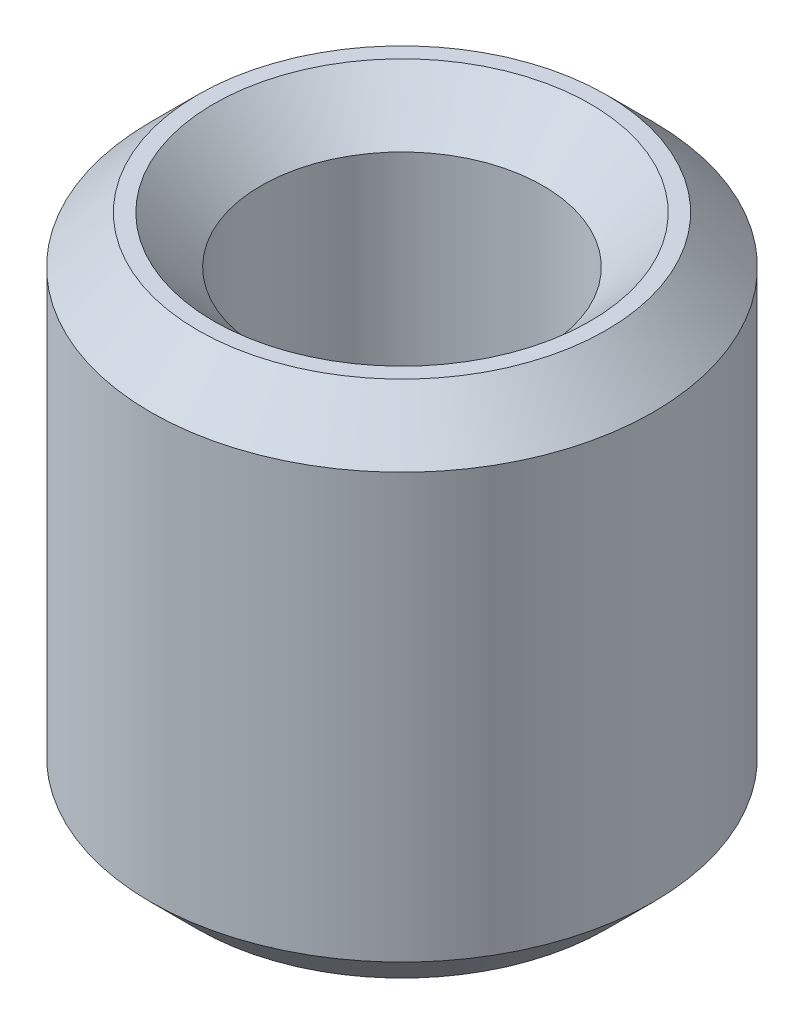
ISO-10303-21;
HEADER;
FILE_DESCRIPTION(('STEP AP214'),'2;1');
FILE_NAME('part.step','',(''),(''),'','','');
FILE_SCHEMA(('AUTOMOTIVE_DESIGN { 1 0 10303 214 1 1 1 1 }'));
ENDSEC;
DATA;
#1=APPLICATION_CONTEXT('core data for automotive mechanical design processes');
#2=APPLICATION_PROTOCOL_DEFINITION('international standard','automotive_design',2000,#1);
#3=PRODUCT_CONTEXT('',#1,'mechanical');
#4=PRODUCT('Part','Part','',(#3));
#5=PRODUCT_RELATED_PRODUCT_CATEGORY('part','',(#4));
#6=PRODUCT_DEFINITION_FORMATION('','',#4);
#7=PRODUCT_DEFINITION_CONTEXT('part definition',#1,'design');
#8=PRODUCT_DEFINITION('design','',#6,#7);
#9=PRODUCT_DEFINITION_SHAPE('','',#8);
#10=(LENGTH_UNIT() NAMED_UNIT(*) SI_UNIT(.MILLI.,.METRE.));
#11=(NAMED_UNIT(*) PLANE_ANGLE_UNIT() SI_UNIT($,.RADIAN.));
#12=(NAMED_UNIT(*) SI_UNIT($,.STERADIAN.) SOLID_ANGLE_UNIT());
#13=UNCERTAINTY_MEASURE_WITH_UNIT(LENGTH_MEASURE(1.E-05),#10,'distance_accuracy_value','');
#14=(GEOMETRIC_REPRESENTATION_CONTEXT(3) GLOBAL_UNCERTAINTY_ASSIGNED_CONTEXT((#13)) GLOBAL_UNIT_ASSIGNED_CONTEXT((#10,
#11,#12)) REPRESENTATION_CONTEXT('',''));
#15=CARTESIAN_POINT('',(0.,0.,0.));
#16=DIRECTION('',(0.,0.,1.));
#17=DIRECTION('',(1.,0.,0.));
#18=AXIS2_PLACEMENT_3D('',#15,#16,#17);
#19=CARTESIAN_POINT('',(0.,36.1168653407432,0.));
#20=DIRECTION('',(0.,-1.,0.));
#21=DIRECTION('',(0.,0.,-1.));
#22=AXIS2_PLACEMENT_3D('',#19,#20,#21);
#23=CYLINDRICAL_SURFACE('',#22,17.5);
#24=CARTESIAN_POINT('',(0.,3.28979747917948,0.));
#25=DIRECTION('',(0.,1.,0.));
#26=DIRECTION('',(0.,0.,1.));
#27=AXIS2_PLACEMENT_3D('',#24,#25,#26);
#28=CIRCLE('',#27,17.5);
#29=CARTESIAN_POINT('',(0.,3.28979747917948,17.5));
#30=VERTEX_POINT('',#29);
#31=EDGE_CURVE('E10',#30,#30,#28,.T.);
#32=ORIENTED_EDGE('',*,*,#31,.T.);
#33=EDGE_LOOP('',(#32));
#34=FACE_BOUND('',#33,.T.);
#35=CARTESIAN_POINT('',(0.,32.8270678615637,0.));
#36=DIRECTION('',(0.,1.,0.));
#37=DIRECTION('',(0.,0.,1.));
#38=AXIS2_PLACEMENT_3D('',#35,#36,#37);
#39=CIRCLE('',#38,17.5);
#40=CARTESIAN_POINT('',(0.,32.8270678615637,17.5));
#41=VERTEX_POINT('',#40);
#42=EDGE_CURVE('E50',#41,#41,#39,.F.);
#43=ORIENTED_EDGE('',*,*,#42,.T.);
#44=EDGE_LOOP('',(#43));
#45=FACE_BOUND('',#44,.T.);
#46=ADVANCED_FACE('F39',(#34,#45),#23,.T.);
#47=CARTESIAN_POINT('',(0.,36.1168653407432,0.));
#48=DIRECTION('',(0.,1.,0.));
#49=DIRECTION('',(0.,0.,1.));
#50=AXIS2_PLACEMENT_3D('',#47,#48,#49);
#51=PLANE('',#50);
#52=CARTESIAN_POINT('',(0.,36.1168653407432,0.));
#53=DIRECTION('',(0.,1.,0.));
#54=DIRECTION('',(0.,0.,1.));
#55=AXIS2_PLACEMENT_3D('',#52,#53,#54);
#56=CIRCLE('',#55,13.1068154976435);
#57=CARTESIAN_POINT('',(0.,36.1168653407432,13.1068154976435));
#58=VERTEX_POINT('',#57);
#59=EDGE_CURVE('E58',#58,#58,#56,.F.);
#60=ORIENTED_EDGE('',*,*,#59,.T.);
#61=EDGE_LOOP('',(#60));
#62=FACE_BOUND('',#61,.T.);
#63=CARTESIAN_POINT('',(0.,36.1168653407432,0.));
#64=DIRECTION('',(0.,1.,0.));
#65=DIRECTION('',(0.,0.,1.));
#66=AXIS2_PLACEMENT_3D('',#63,#64,#65);
#67=CIRCLE('',#66,14.2102025208205);
#68=CARTESIAN_POINT('',(0.,36.1168653407432,14.2102025208205));
#69=VERTEX_POINT('',#68);
#70=EDGE_CURVE('E61',#69,#69,#67,.T.);
#71=ORIENTED_EDGE('',*,*,#70,.T.);
#72=EDGE_LOOP('',(#71));
#73=FACE_BOUND('',#72,.T.);
#74=ADVANCED_FACE('F88',(#62,#73),#51,.T.);
#75=CARTESIAN_POINT('',(0.,0.,0.));
#76=DIRECTION('',(0.,1.,0.));
#77=DIRECTION('',(0.,0.,1.));
#78=AXIS2_PLACEMENT_3D('',#75,#76,#77);
#79=PLANE('',#78);
#80=CARTESIAN_POINT('',(0.,0.,0.));
#81=DIRECTION('',(0.,1.,0.));
#82=DIRECTION('',(0.,0.,1.));
#83=AXIS2_PLACEMENT_3D('',#80,#81,#82);
#84=CIRCLE('',#83,13.1068154976435);
#85=CARTESIAN_POINT('',(0.,0.,13.1068154976435));
#86=VERTEX_POINT('',#85);
#87=EDGE_CURVE('E51',#86,#86,#84,.T.);
#88=ORIENTED_EDGE('',*,*,#87,.T.);
#89=EDGE_LOOP('',(#88));
#90=FACE_BOUND('',#89,.T.);
#91=CARTESIAN_POINT('',(0.,0.,0.));
#92=DIRECTION('',(0.,1.,0.));
#93=DIRECTION('',(0.,0.,1.));
#94=AXIS2_PLACEMENT_3D('',#91,#92,#93);
#95=CIRCLE('',#94,14.2102025208205);
#96=CARTESIAN_POINT('',(0.,0.,14.2102025208205));
#97=VERTEX_POINT('',#96);
#98=EDGE_CURVE('E54',#97,#97,#95,.F.);
#99=ORIENTED_EDGE('',*,*,#98,.T.);
#100=EDGE_LOOP('',(#99));
#101=FACE_BOUND('',#100,.T.);
#102=ADVANCED_FACE('F83',(#90,#101),#79,.F.);
#103=CARTESIAN_POINT('',(0.,36.1168653407432,0.));
#104=DIRECTION('',(0.,-1.,0.));
#105=DIRECTION('',(0.,0.,-1.));
#106=AXIS2_PLACEMENT_3D('',#103,#104,#105);
#107=CYLINDRICAL_SURFACE('',#106,9.81701801846404);
#108=CARTESIAN_POINT('',(0.,32.8270678615637,0.));
#109=DIRECTION('',(0.,1.,0.));
#110=DIRECTION('',(0.,0.,1.));
#111=AXIS2_PLACEMENT_3D('',#108,#109,#110);
#112=CIRCLE('',#111,9.81701801846404);
#113=CARTESIAN_POINT('',(0.,32.8270678615637,9.81701801846404));
#114=VERTEX_POINT('',#113);
#115=EDGE_CURVE('E67',#114,#114,#112,.T.);
#116=ORIENTED_EDGE('',*,*,#115,.T.);
#117=EDGE_LOOP('',(#116));
#118=FACE_BOUND('',#117,.T.);
#119=CARTESIAN_POINT('',(0.,3.2897974791795,0.));
#120=DIRECTION('',(0.,1.,0.));
#121=DIRECTION('',(0.,0.,1.));
#122=AXIS2_PLACEMENT_3D('',#119,#120,#121);
#123=CIRCLE('',#122,9.81701801846404);
#124=CARTESIAN_POINT('',(0.,3.2897974791795,9.81701801846404));
#125=VERTEX_POINT('',#124);
#126=EDGE_CURVE('E69',#125,#125,#123,.F.);
#127=ORIENTED_EDGE('',*,*,#126,.T.);
#128=EDGE_LOOP('',(#127));
#129=FACE_BOUND('',#128,.T.);
#130=ADVANCED_FACE('F71',(#118,#129),#107,.F.);
#131=CARTESIAN_POINT('',(0.,32.8270678615637,0.));
#132=DIRECTION('',(0.,1.,0.));
#133=DIRECTION('',(0.,0.,1.));
#134=AXIS2_PLACEMENT_3D('',#131,#132,#133);
#135=CONICAL_SURFACE('',#134,9.81701801846404,0.785398163397452);
#136=ORIENTED_EDGE('',*,*,#59,.F.);
#137=EDGE_LOOP('',(#136));
#138=FACE_BOUND('',#137,.T.);
#139=ORIENTED_EDGE('',*,*,#115,.F.);
#140=EDGE_LOOP('',(#139));
#141=FACE_BOUND('',#140,.T.);
#142=ADVANCED_FACE('F77',(#138,#141),#135,.F.);
#143=CARTESIAN_POINT('',(0.,0.,0.));
#144=DIRECTION('',(0.,-1.,0.));
#145=DIRECTION('',(0.,0.,-1.));
#146=AXIS2_PLACEMENT_3D('',#143,#144,#145);
#147=CONICAL_SURFACE('',#146,13.1068154976435,0.785398163397445);
#148=ORIENTED_EDGE('',*,*,#126,.F.);
#149=EDGE_LOOP('',(#148));
#150=FACE_BOUND('',#149,.T.);
#151=ORIENTED_EDGE('',*,*,#87,.F.);
#152=EDGE_LOOP('',(#151));
#153=FACE_BOUND('',#152,.T.);
#154=ADVANCED_FACE('F73',(#150,#153),#147,.F.);
#155=CARTESIAN_POINT('',(0.,3.28979747917948,0.));
#156=DIRECTION('',(0.,1.,0.));
#157=DIRECTION('',(0.,0.,1.));
#158=AXIS2_PLACEMENT_3D('',#155,#156,#157);
#159=CONICAL_SURFACE('',#158,17.5,0.785398163397452);
#160=ORIENTED_EDGE('',*,*,#98,.F.);
#161=EDGE_LOOP('',(#160));
#162=FACE_BOUND('',#161,.T.);
#163=ORIENTED_EDGE('',*,*,#31,.F.);
#164=EDGE_LOOP('',(#163));
#165=FACE_BOUND('',#164,.T.);
#166=ADVANCED_FACE('F76',(#162,#165),#159,.T.);
#167=CARTESIAN_POINT('',(0.,36.1168653407432,0.));
#168=DIRECTION('',(0.,-1.,0.));
#169=DIRECTION('',(0.,0.,-1.));
#170=AXIS2_PLACEMENT_3D('',#167,#168,#169);
#171=CONICAL_SURFACE('',#170,14.2102025208205,0.785398163397446);
#172=ORIENTED_EDGE('',*,*,#42,.F.);
#173=EDGE_LOOP('',(#172));
#174=FACE_BOUND('',#173,.T.);
#175=ORIENTED_EDGE('',*,*,#70,.F.);
#176=EDGE_LOOP('',(#175));
#177=FACE_BOUND('',#176,.T.);
#178=ADVANCED_FACE('F45',(#174,#177),#171,.T.);
#179=CLOSED_SHELL('',(#46,#74,#102,#130,#142,#154,#166,#178));
#180=MANIFOLD_SOLID_BREP('B2',#179);
#181=ADVANCED_BREP_SHAPE_REPRESENTATION('',(#18,#180),#14);
#182=SHAPE_DEFINITION_REPRESENTATION(#9,#181);
ENDSEC;
END-ISO-10303-21;
